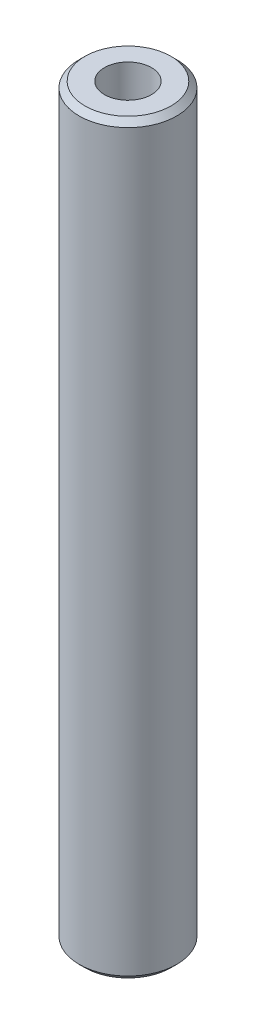
ISO-10303-21;
HEADER;
FILE_DESCRIPTION(('STEP AP214'),'2;1');
FILE_NAME('part.step','',(''),(''),'','','');
FILE_SCHEMA(('AUTOMOTIVE_DESIGN { 1 0 10303 214 1 1 1 1 }'));
ENDSEC;
DATA;
#1=APPLICATION_CONTEXT('core data for automotive mechanical design processes');
#2=APPLICATION_PROTOCOL_DEFINITION('international standard','automotive_design',2000,#1);
#3=PRODUCT_CONTEXT('',#1,'mechanical');
#4=PRODUCT('Part','Part','',(#3));
#5=PRODUCT_RELATED_PRODUCT_CATEGORY('part','',(#4));
#6=PRODUCT_DEFINITION_FORMATION('','',#4);
#7=PRODUCT_DEFINITION_CONTEXT('part definition',#1,'design');
#8=PRODUCT_DEFINITION('design','',#6,#7);
#9=PRODUCT_DEFINITION_SHAPE('','',#8);
#10=(LENGTH_UNIT() NAMED_UNIT(*) SI_UNIT(.MILLI.,.METRE.));
#11=(NAMED_UNIT(*) PLANE_ANGLE_UNIT() SI_UNIT($,.RADIAN.));
#12=(NAMED_UNIT(*) SI_UNIT($,.STERADIAN.) SOLID_ANGLE_UNIT());
#13=UNCERTAINTY_MEASURE_WITH_UNIT(LENGTH_MEASURE(1.E-05),#10,'distance_accuracy_value','');
#14=(GEOMETRIC_REPRESENTATION_CONTEXT(3) GLOBAL_UNCERTAINTY_ASSIGNED_CONTEXT((#13)) GLOBAL_UNIT_ASSIGNED_CONTEXT((#10,
#11,#12)) REPRESENTATION_CONTEXT('',''));
#15=CARTESIAN_POINT('',(0.,0.,0.));
#16=DIRECTION('',(0.,0.,1.));
#17=DIRECTION('',(1.,0.,0.));
#18=AXIS2_PLACEMENT_3D('',#15,#16,#17);
#19=CARTESIAN_POINT('',(0.,344.018809649537,0.));
#20=DIRECTION('',(0.,-1.,0.));
#21=DIRECTION('',(0.,0.,-1.));
#22=AXIS2_PLACEMENT_3D('',#19,#20,#21);
#23=CYLINDRICAL_SURFACE('',#22,22.5);
#24=CARTESIAN_POINT('',(0.,341.350943829564,0.));
#25=DIRECTION('',(0.,1.,0.));
#26=DIRECTION('',(0.,0.,1.));
#27=AXIS2_PLACEMENT_3D('',#24,#25,#26);
#28=CIRCLE('',#27,22.5);
#29=CARTESIAN_POINT('',(0.,341.350943829564,22.5));
#30=VERTEX_POINT('',#29);
#31=EDGE_CURVE('E50',#30,#30,#28,.F.);
#32=ORIENTED_EDGE('',*,*,#31,.T.);
#33=EDGE_LOOP('',(#32));
#34=FACE_BOUND('',#33,.T.);
#35=CARTESIAN_POINT('',(0.,2.66786581997308,0.));
#36=DIRECTION('',(0.,1.,0.));
#37=DIRECTION('',(0.,0.,1.));
#38=AXIS2_PLACEMENT_3D('',#35,#36,#37);
#39=CIRCLE('',#38,22.5);
#40=CARTESIAN_POINT('',(0.,2.66786581997308,22.5));
#41=VERTEX_POINT('',#40);
#42=EDGE_CURVE('E51',#41,#41,#39,.T.);
#43=ORIENTED_EDGE('',*,*,#42,.T.);
#44=EDGE_LOOP('',(#43));
#45=FACE_BOUND('',#44,.T.);
#46=ADVANCED_FACE('F39',(#34,#45),#23,.T.);
#47=CARTESIAN_POINT('',(0.,344.018809649537,0.));
#48=DIRECTION('',(0.,1.,0.));
#49=DIRECTION('',(0.,0.,1.));
#50=AXIS2_PLACEMENT_3D('',#47,#48,#49);
#51=PLANE('',#50);
#52=CARTESIAN_POINT('',(0.,344.018809649537,0.));
#53=DIRECTION('',(0.,1.,0.));
#54=DIRECTION('',(0.,0.,1.));
#55=AXIS2_PLACEMENT_3D('',#52,#53,#54);
#56=CIRCLE('',#55,19.8321341800268);
#57=CARTESIAN_POINT('',(0.,344.018809649537,19.8321341800268));
#58=VERTEX_POINT('',#57);
#59=EDGE_CURVE('E54',#58,#58,#56,.T.);
#60=ORIENTED_EDGE('',*,*,#59,.T.);
#61=EDGE_LOOP('',(#60));
#62=FACE_BOUND('',#61,.T.);
#63=CARTESIAN_POINT('',(0.,344.018809649537,0.));
#64=DIRECTION('',(0.,1.,0.));
#65=DIRECTION('',(0.,0.,1.));
#66=AXIS2_PLACEMENT_3D('',#63,#64,#65);
#67=CIRCLE('',#66,10.8215497680543);
#68=CARTESIAN_POINT('',(0.,344.018809649537,10.8215497680543));
#69=VERTEX_POINT('',#68);
#70=EDGE_CURVE('E58',#69,#69,#67,.T.);
#71=ORIENTED_EDGE('',*,*,#70,.F.);
#72=EDGE_LOOP('',(#71));
#73=FACE_BOUND('',#72,.T.);
#74=ADVANCED_FACE('F69',(#62,#73),#51,.T.);
#75=CARTESIAN_POINT('',(0.,0.,0.));
#76=DIRECTION('',(0.,1.,0.));
#77=DIRECTION('',(0.,0.,1.));
#78=AXIS2_PLACEMENT_3D('',#75,#76,#77);
#79=PLANE('',#78);
#80=CARTESIAN_POINT('',(0.,0.,0.));
#81=DIRECTION('',(0.,1.,0.));
#82=DIRECTION('',(0.,0.,1.));
#83=AXIS2_PLACEMENT_3D('',#80,#81,#82);
#84=CIRCLE('',#83,19.8321341800269);
#85=CARTESIAN_POINT('',(0.,0.,19.8321341800269));
#86=VERTEX_POINT('',#85);
#87=EDGE_CURVE('E10',#86,#86,#84,.F.);
#88=ORIENTED_EDGE('',*,*,#87,.T.);
#89=EDGE_LOOP('',(#88));
#90=FACE_BOUND('',#89,.T.);
#91=CARTESIAN_POINT('',(0.,0.,0.));
#92=DIRECTION('',(0.,1.,0.));
#93=DIRECTION('',(0.,0.,1.));
#94=AXIS2_PLACEMENT_3D('',#91,#92,#93);
#95=CIRCLE('',#94,10.8215497680543);
#96=CARTESIAN_POINT('',(0.,0.,10.8215497680543));
#97=VERTEX_POINT('',#96);
#98=EDGE_CURVE('E63',#97,#97,#95,.T.);
#99=ORIENTED_EDGE('',*,*,#98,.T.);
#100=EDGE_LOOP('',(#99));
#101=FACE_BOUND('',#100,.T.);
#102=ADVANCED_FACE('F75',(#90,#101),#79,.F.);
#103=CARTESIAN_POINT('',(0.,344.018809649537,0.));
#104=DIRECTION('',(0.,-1.,0.));
#105=DIRECTION('',(0.,0.,-1.));
#106=AXIS2_PLACEMENT_3D('',#103,#104,#105);
#107=CYLINDRICAL_SURFACE('',#106,10.8215497680543);
#108=ORIENTED_EDGE('',*,*,#70,.T.);
#109=EDGE_LOOP('',(#108));
#110=FACE_BOUND('',#109,.T.);
#111=ORIENTED_EDGE('',*,*,#98,.F.);
#112=EDGE_LOOP('',(#111));
#113=FACE_BOUND('',#112,.T.);
#114=ADVANCED_FACE('F70',(#110,#113),#107,.F.);
#115=CARTESIAN_POINT('',(0.,344.018809649537,0.));
#116=DIRECTION('',(0.,-1.,0.));
#117=DIRECTION('',(0.,0.,-1.));
#118=AXIS2_PLACEMENT_3D('',#115,#116,#117);
#119=CONICAL_SURFACE('',#118,19.8321341800268,0.785398163397445);
#120=ORIENTED_EDGE('',*,*,#31,.F.);
#121=EDGE_LOOP('',(#120));
#122=FACE_BOUND('',#121,.T.);
#123=ORIENTED_EDGE('',*,*,#59,.F.);
#124=EDGE_LOOP('',(#123));
#125=FACE_BOUND('',#124,.T.);
#126=ADVANCED_FACE('F81',(#122,#125),#119,.T.);
#127=CARTESIAN_POINT('',(0.,2.66786581997308,0.));
#128=DIRECTION('',(0.,1.,0.));
#129=DIRECTION('',(0.,0.,1.));
#130=AXIS2_PLACEMENT_3D('',#127,#128,#129);
#131=CONICAL_SURFACE('',#130,22.5,0.785398163397451);
#132=ORIENTED_EDGE('',*,*,#87,.F.);
#133=EDGE_LOOP('',(#132));
#134=FACE_BOUND('',#133,.T.);
#135=ORIENTED_EDGE('',*,*,#42,.F.);
#136=EDGE_LOOP('',(#135));
#137=FACE_BOUND('',#136,.T.);
#138=ADVANCED_FACE('F45',(#134,#137),#131,.T.);
#139=CLOSED_SHELL('',(#46,#74,#102,#114,#126,#138));
#140=MANIFOLD_SOLID_BREP('B2',#139);
#141=ADVANCED_BREP_SHAPE_REPRESENTATION('',(#18,#140),#14);
#142=SHAPE_DEFINITION_REPRESENTATION(#9,#141);
ENDSEC;
END-ISO-10303-21;
